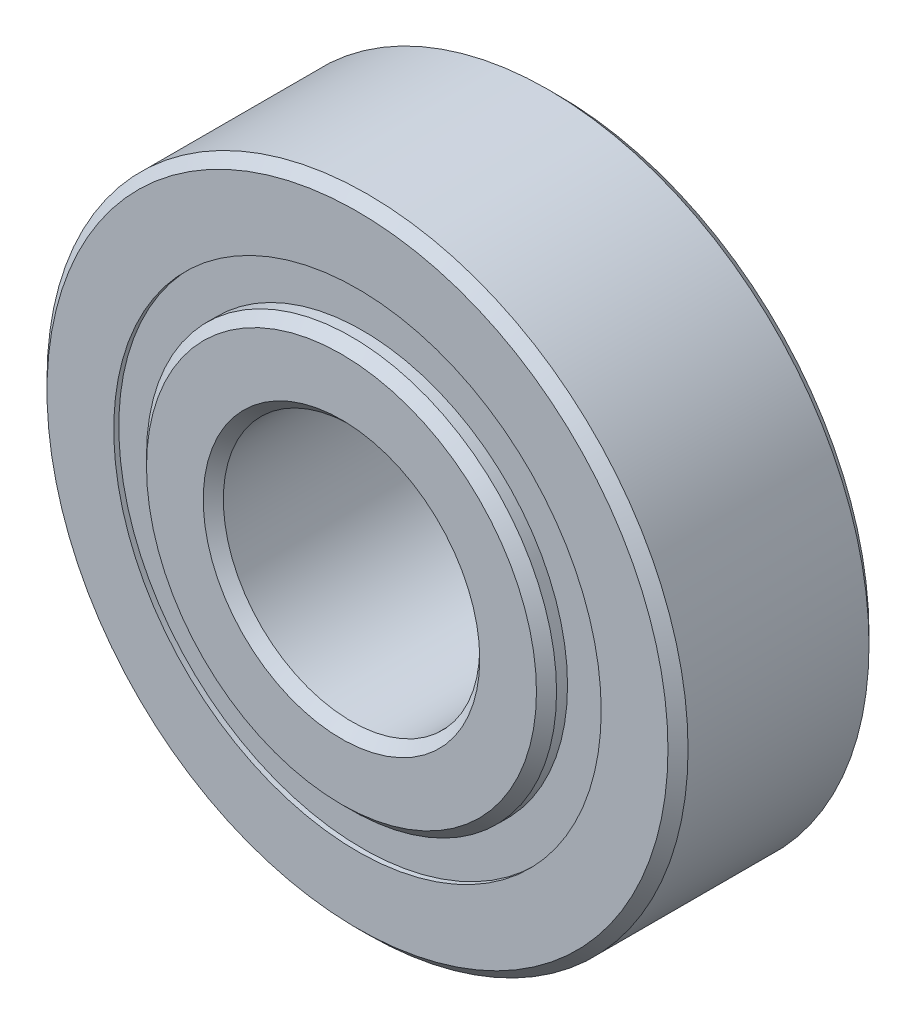
ISO-10303-21;
HEADER;
FILE_DESCRIPTION(('STEP AP214'),'2;1');
FILE_NAME('part.step','',(''),(''),'','','');
FILE_SCHEMA(('AUTOMOTIVE_DESIGN { 1 0 10303 214 1 1 1 1 }'));
ENDSEC;
DATA;
#1=APPLICATION_CONTEXT('core data for automotive mechanical design processes');
#2=APPLICATION_PROTOCOL_DEFINITION('international standard','automotive_design',2000,#1);
#3=PRODUCT_CONTEXT('',#1,'mechanical');
#4=PRODUCT('Part','Part','',(#3));
#5=PRODUCT_RELATED_PRODUCT_CATEGORY('part','',(#4));
#6=PRODUCT_DEFINITION_FORMATION('','',#4);
#7=PRODUCT_DEFINITION_CONTEXT('part definition',#1,'design');
#8=PRODUCT_DEFINITION('design','',#6,#7);
#9=PRODUCT_DEFINITION_SHAPE('','',#8);
#10=(LENGTH_UNIT() NAMED_UNIT(*) SI_UNIT(.MILLI.,.METRE.));
#11=(NAMED_UNIT(*) PLANE_ANGLE_UNIT() SI_UNIT($,.RADIAN.));
#12=(NAMED_UNIT(*) SI_UNIT($,.STERADIAN.) SOLID_ANGLE_UNIT());
#13=UNCERTAINTY_MEASURE_WITH_UNIT(LENGTH_MEASURE(1.E-05),#10,'distance_accuracy_value','');
#14=(GEOMETRIC_REPRESENTATION_CONTEXT(3) GLOBAL_UNCERTAINTY_ASSIGNED_CONTEXT((#13)) GLOBAL_UNIT_ASSIGNED_CONTEXT((#10,
#11,#12)) REPRESENTATION_CONTEXT('',''));
#15=CARTESIAN_POINT('',(0.,0.,0.));
#16=DIRECTION('',(0.,0.,1.));
#17=DIRECTION('',(1.,0.,0.));
#18=AXIS2_PLACEMENT_3D('',#15,#16,#17);
#19=CARTESIAN_POINT('',(0.,6.03522142857143,-2.36474));
#20=DIRECTION('',(0.,0.,1.));
#21=DIRECTION('',(1.,0.,0.));
#22=AXIS2_PLACEMENT_3D('',#19,#20,#21);
#23=PLANE('',#22);
#24=CARTESIAN_POINT('',(0.,0.,-2.36474));
#25=DIRECTION('',(0.,0.,1.));
#26=DIRECTION('',(1.,0.,0.));
#27=AXIS2_PLACEMENT_3D('',#24,#25,#26);
#28=CIRCLE('',#27,6.03522142857143);
#29=CARTESIAN_POINT('',(6.03522142857143,0.,-2.36474));
#30=VERTEX_POINT('',#29);
#31=EDGE_CURVE('E59',#30,#30,#28,.T.);
#32=ORIENTED_EDGE('',*,*,#31,.F.);
#33=EDGE_LOOP('',(#32));
#34=FACE_BOUND('',#33,.T.);
#35=CARTESIAN_POINT('',(0.,0.,-2.36474));
#36=DIRECTION('',(0.,0.,1.));
#37=DIRECTION('',(1.,0.,0.));
#38=AXIS2_PLACEMENT_3D('',#35,#36,#37);
#39=CIRCLE('',#38,5.07727857142857);
#40=CARTESIAN_POINT('',(5.07727857142857,0.,-2.36474));
#41=VERTEX_POINT('',#40);
#42=EDGE_CURVE('E11',#41,#41,#39,.T.);
#43=ORIENTED_EDGE('',*,*,#42,.T.);
#44=EDGE_LOOP('',(#43));
#45=FACE_BOUND('',#44,.T.);
#46=ADVANCED_FACE('F45',(#34,#45),#23,.F.);
#47=CARTESIAN_POINT('',(0.,0.,2.4892));
#48=DIRECTION('',(0.,0.,1.));
#49=DIRECTION('',(1.,0.,0.));
#50=AXIS2_PLACEMENT_3D('',#47,#48,#49);
#51=CYLINDRICAL_SURFACE('',#50,5.07727857142857);
#52=ORIENTED_EDGE('',*,*,#42,.F.);
#53=EDGE_LOOP('',(#52));
#54=FACE_BOUND('',#53,.T.);
#55=CARTESIAN_POINT('',(0.,0.,-1.20554465033679));
#56=DIRECTION('',(0.,0.,1.));
#57=DIRECTION('',(1.,0.,0.));
#58=AXIS2_PLACEMENT_3D('',#55,#56,#57);
#59=CIRCLE('',#58,5.07727857142857);
#60=CARTESIAN_POINT('',(5.07727857142857,0.,-1.20554465033679));
#61=VERTEX_POINT('',#60);
#62=EDGE_CURVE('E51',#61,#61,#59,.T.);
#63=ORIENTED_EDGE('',*,*,#62,.T.);
#64=EDGE_LOOP('',(#63));
#65=FACE_BOUND('',#64,.T.);
#66=ADVANCED_FACE('F68',(#54,#65),#51,.F.);
#67=CARTESIAN_POINT('',(0.,6.03522142857143,-1.20554465033679));
#68=DIRECTION('',(0.,0.,-1.));
#69=DIRECTION('',(-1.,0.,0.));
#70=AXIS2_PLACEMENT_3D('',#67,#68,#69);
#71=PLANE('',#70);
#72=ORIENTED_EDGE('',*,*,#62,.F.);
#73=EDGE_LOOP('',(#72));
#74=FACE_BOUND('',#73,.T.);
#75=CARTESIAN_POINT('',(0.,0.,-1.20554465033679));
#76=DIRECTION('',(0.,0.,1.));
#77=DIRECTION('',(1.,0.,0.));
#78=AXIS2_PLACEMENT_3D('',#75,#76,#77);
#79=CIRCLE('',#78,6.03522142857143);
#80=CARTESIAN_POINT('',(6.03522142857143,0.,-1.20554465033679));
#81=VERTEX_POINT('',#80);
#82=EDGE_CURVE('E55',#81,#81,#79,.T.);
#83=ORIENTED_EDGE('',*,*,#82,.T.);
#84=EDGE_LOOP('',(#83));
#85=FACE_BOUND('',#84,.T.);
#86=ADVANCED_FACE('F72',(#74,#85),#71,.F.);
#87=CARTESIAN_POINT('',(0.,0.,2.4892));
#88=DIRECTION('',(0.,0.,1.));
#89=DIRECTION('',(1.,0.,0.));
#90=AXIS2_PLACEMENT_3D('',#87,#88,#89);
#91=CYLINDRICAL_SURFACE('',#90,6.03522142857143);
#92=ORIENTED_EDGE('',*,*,#82,.F.);
#93=EDGE_LOOP('',(#92));
#94=FACE_BOUND('',#93,.T.);
#95=ORIENTED_EDGE('',*,*,#31,.T.);
#96=EDGE_LOOP('',(#95));
#97=FACE_BOUND('',#96,.T.);
#98=ADVANCED_FACE('F65',(#94,#97),#91,.T.);
#99=CLOSED_SHELL('',(#46,#66,#86,#98));
#100=MANIFOLD_SOLID_BREP('B2',#99);
#101=CARTESIAN_POINT('',(0.,6.03522142857143,2.36474));
#102=DIRECTION('',(0.,0.,-1.));
#103=DIRECTION('',(-1.,0.,0.));
#104=AXIS2_PLACEMENT_3D('',#101,#102,#103);
#105=PLANE('',#104);
#106=CARTESIAN_POINT('',(0.,0.,2.36474));
#107=DIRECTION('',(0.,0.,1.));
#108=DIRECTION('',(1.,0.,0.));
#109=AXIS2_PLACEMENT_3D('',#106,#107,#108);
#110=CIRCLE('',#109,5.07727857142857);
#111=CARTESIAN_POINT('',(5.07727857142857,0.,2.36474));
#112=VERTEX_POINT('',#111);
#113=EDGE_CURVE('E44',#112,#112,#110,.T.);
#114=ORIENTED_EDGE('',*,*,#113,.F.);
#115=EDGE_LOOP('',(#114));
#116=FACE_BOUND('',#115,.T.);
#117=CARTESIAN_POINT('',(0.,0.,2.36474));
#118=DIRECTION('',(0.,0.,1.));
#119=DIRECTION('',(1.,0.,0.));
#120=AXIS2_PLACEMENT_3D('',#117,#118,#119);
#121=CIRCLE('',#120,6.03522142857143);
#122=CARTESIAN_POINT('',(6.03522142857143,0.,2.36474));
#123=VERTEX_POINT('',#122);
#124=EDGE_CURVE('E126',#123,#123,#121,.T.);
#125=ORIENTED_EDGE('',*,*,#124,.T.);
#126=EDGE_LOOP('',(#125));
#127=FACE_BOUND('',#126,.T.);
#128=ADVANCED_FACE('F112',(#116,#127),#105,.F.);
#129=CARTESIAN_POINT('',(0.,0.,2.4892));
#130=DIRECTION('',(0.,0.,1.));
#131=DIRECTION('',(1.,0.,0.));
#132=AXIS2_PLACEMENT_3D('',#129,#130,#131);
#133=CYLINDRICAL_SURFACE('',#132,5.07727857142857);
#134=CARTESIAN_POINT('',(0.,0.,1.20554465033679));
#135=DIRECTION('',(0.,0.,1.));
#136=DIRECTION('',(1.,0.,0.));
#137=AXIS2_PLACEMENT_3D('',#134,#135,#136);
#138=CIRCLE('',#137,5.07727857142857);
#139=CARTESIAN_POINT('',(5.07727857142857,0.,1.20554465033679));
#140=VERTEX_POINT('',#139);
#141=EDGE_CURVE('E118',#140,#140,#138,.T.);
#142=ORIENTED_EDGE('',*,*,#141,.F.);
#143=EDGE_LOOP('',(#142));
#144=FACE_BOUND('',#143,.T.);
#145=ORIENTED_EDGE('',*,*,#113,.T.);
#146=EDGE_LOOP('',(#145));
#147=FACE_BOUND('',#146,.T.);
#148=ADVANCED_FACE('F141',(#144,#147),#133,.F.);
#149=CARTESIAN_POINT('',(0.,6.03522142857143,1.20554465033679));
#150=DIRECTION('',(0.,0.,1.));
#151=DIRECTION('',(1.,0.,0.));
#152=AXIS2_PLACEMENT_3D('',#149,#150,#151);
#153=PLANE('',#152);
#154=CARTESIAN_POINT('',(0.,0.,1.20554465033679));
#155=DIRECTION('',(0.,0.,1.));
#156=DIRECTION('',(1.,0.,0.));
#157=AXIS2_PLACEMENT_3D('',#154,#155,#156);
#158=CIRCLE('',#157,6.03522142857143);
#159=CARTESIAN_POINT('',(6.03522142857143,0.,1.20554465033679));
#160=VERTEX_POINT('',#159);
#161=EDGE_CURVE('E122',#160,#160,#158,.T.);
#162=ORIENTED_EDGE('',*,*,#161,.F.);
#163=EDGE_LOOP('',(#162));
#164=FACE_BOUND('',#163,.T.);
#165=ORIENTED_EDGE('',*,*,#141,.T.);
#166=EDGE_LOOP('',(#165));
#167=FACE_BOUND('',#166,.T.);
#168=ADVANCED_FACE('F136',(#164,#167),#153,.F.);
#169=CARTESIAN_POINT('',(0.,0.,2.4892));
#170=DIRECTION('',(0.,0.,1.));
#171=DIRECTION('',(1.,0.,0.));
#172=AXIS2_PLACEMENT_3D('',#169,#170,#171);
#173=CYLINDRICAL_SURFACE('',#172,6.03522142857143);
#174=ORIENTED_EDGE('',*,*,#124,.F.);
#175=EDGE_LOOP('',(#174));
#176=FACE_BOUND('',#175,.T.);
#177=ORIENTED_EDGE('',*,*,#161,.T.);
#178=EDGE_LOOP('',(#177));
#179=FACE_BOUND('',#178,.T.);
#180=ADVANCED_FACE('F133',(#176,#179),#173,.T.);
#181=CLOSED_SHELL('',(#128,#148,#168,#180));
#182=MANIFOLD_SOLID_BREP('B6',#181);
#183=CARTESIAN_POINT('',(-2.77812499999994,4.81185364977732,0.));
#184=DIRECTION('',(0.,0.,1.));
#185=DIRECTION('',(-0.499999999999989,0.866025403784445,0.));
#186=AXIS2_PLACEMENT_3D('',#183,#184,#185);
#187=SPHERICAL_SURFACE('',#186,1.20554465033679);
#188=CARTESIAN_POINT('',(-2.77812499999994,4.81185364977732,1.20554465033679));
#189=VERTEX_POINT('',#188);
#190=VERTEX_LOOP('',#189);
#191=FACE_BOUND('',#190,.T.);
#192=ADVANCED_FACE('F179',(#191),#187,.T.);
#193=CLOSED_SHELL('',(#192));
#194=MANIFOLD_SOLID_BREP('B39',#193);
#195=CARTESIAN_POINT('',(-4.81185364977726,2.77812500000006,0.));
#196=DIRECTION('',(0.,0.,1.));
#197=DIRECTION('',(-0.866025403784433,0.50000000000001,0.));
#198=AXIS2_PLACEMENT_3D('',#195,#196,#197);
#199=SPHERICAL_SURFACE('',#198,1.20554465033679);
#200=CARTESIAN_POINT('',(-4.81185364977726,2.77812500000006,1.20554465033679));
#201=VERTEX_POINT('',#200);
#202=VERTEX_LOOP('',#201);
#203=FACE_BOUND('',#202,.T.);
#204=ADVANCED_FACE('F199',(#203),#199,.T.);
#205=CLOSED_SHELL('',(#204));
#206=MANIFOLD_SOLID_BREP('B108',#205);
#207=CARTESIAN_POINT('',(-5.55625,0.,0.));
#208=DIRECTION('',(0.,0.,1.));
#209=DIRECTION('',(-1.,0.,0.));
#210=AXIS2_PLACEMENT_3D('',#207,#208,#209);
#211=SPHERICAL_SURFACE('',#210,1.20554465033679);
#212=CARTESIAN_POINT('',(-5.55625,0.,1.20554465033679));
#213=VERTEX_POINT('',#212);
#214=VERTEX_LOOP('',#213);
#215=FACE_BOUND('',#214,.T.);
#216=ADVANCED_FACE('F219',(#215),#211,.T.);
#217=CLOSED_SHELL('',(#216));
#218=MANIFOLD_SOLID_BREP('B175',#217);
#219=CARTESIAN_POINT('',(-4.81185364977731,-2.77812499999996,0.));
#220=DIRECTION('',(0.,0.,1.));
#221=DIRECTION('',(-0.866025403784443,-0.499999999999992,0.));
#222=AXIS2_PLACEMENT_3D('',#219,#220,#221);
#223=SPHERICAL_SURFACE('',#222,1.20554465033679);
#224=CARTESIAN_POINT('',(-4.81185364977731,-2.77812499999996,1.20554465033679));
#225=VERTEX_POINT('',#224);
#226=VERTEX_LOOP('',#225);
#227=FACE_BOUND('',#226,.T.);
#228=ADVANCED_FACE('F239',(#227),#223,.T.);
#229=CLOSED_SHELL('',(#228));
#230=MANIFOLD_SOLID_BREP('B195',#229);
#231=CARTESIAN_POINT('',(-2.77812500000004,-4.81185364977727,0.));
#232=DIRECTION('',(0.,0.,1.));
#233=DIRECTION('',(-0.500000000000007,-0.866025403784435,0.));
#234=AXIS2_PLACEMENT_3D('',#231,#232,#233);
#235=SPHERICAL_SURFACE('',#234,1.20554465033679);
#236=CARTESIAN_POINT('',(-2.77812500000004,-4.81185364977727,1.20554465033679));
#237=VERTEX_POINT('',#236);
#238=VERTEX_LOOP('',#237);
#239=FACE_BOUND('',#238,.T.);
#240=ADVANCED_FACE('F259',(#239),#235,.T.);
#241=CLOSED_SHELL('',(#240));
#242=MANIFOLD_SOLID_BREP('B215',#241);
#243=CARTESIAN_POINT('',(0.,-5.55625,0.));
#244=DIRECTION('',(0.,0.,1.));
#245=DIRECTION('',(0.,-1.,0.));
#246=AXIS2_PLACEMENT_3D('',#243,#244,#245);
#247=SPHERICAL_SURFACE('',#246,1.20554465033679);
#248=CARTESIAN_POINT('',(0.,-5.55625,1.20554465033679));
#249=VERTEX_POINT('',#248);
#250=VERTEX_LOOP('',#249);
#251=FACE_BOUND('',#250,.T.);
#252=ADVANCED_FACE('F279',(#251),#247,.T.);
#253=CLOSED_SHELL('',(#252));
#254=MANIFOLD_SOLID_BREP('B235',#253);
#255=CARTESIAN_POINT('',(2.77812499999997,-4.8118536497773,0.));
#256=DIRECTION('',(0.,0.,1.));
#257=DIRECTION('',(0.499999999999995,-0.866025403784442,0.));
#258=AXIS2_PLACEMENT_3D('',#255,#256,#257);
#259=SPHERICAL_SURFACE('',#258,1.20554465033679);
#260=CARTESIAN_POINT('',(2.77812499999997,-4.8118536497773,1.20554465033679));
#261=VERTEX_POINT('',#260);
#262=VERTEX_LOOP('',#261);
#263=FACE_BOUND('',#262,.T.);
#264=ADVANCED_FACE('F299',(#263),#259,.T.);
#265=CLOSED_SHELL('',(#264));
#266=MANIFOLD_SOLID_BREP('B255',#265);
#267=CARTESIAN_POINT('',(4.81185364977728,-2.77812500000002,0.));
#268=DIRECTION('',(0.,0.,1.));
#269=DIRECTION('',(0.866025403784436,-0.500000000000004,0.));
#270=AXIS2_PLACEMENT_3D('',#267,#268,#269);
#271=SPHERICAL_SURFACE('',#270,1.20554465033679);
#272=CARTESIAN_POINT('',(4.81185364977728,-2.77812500000002,1.20554465033679));
#273=VERTEX_POINT('',#272);
#274=VERTEX_LOOP('',#273);
#275=FACE_BOUND('',#274,.T.);
#276=ADVANCED_FACE('F319',(#275),#271,.T.);
#277=CLOSED_SHELL('',(#276));
#278=MANIFOLD_SOLID_BREP('B275',#277);
#279=CARTESIAN_POINT('',(5.55625,0.,0.));
#280=DIRECTION('',(0.,0.,1.));
#281=DIRECTION('',(1.,0.,0.));
#282=AXIS2_PLACEMENT_3D('',#279,#280,#281);
#283=SPHERICAL_SURFACE('',#282,1.20554465033679);
#284=CARTESIAN_POINT('',(5.55625,0.,1.20554465033679));
#285=VERTEX_POINT('',#284);
#286=VERTEX_LOOP('',#285);
#287=FACE_BOUND('',#286,.T.);
#288=ADVANCED_FACE('F339',(#287),#283,.T.);
#289=CLOSED_SHELL('',(#288));
#290=MANIFOLD_SOLID_BREP('B295',#289);
#291=CARTESIAN_POINT('',(4.81185364977729,2.77812499999999,0.));
#292=DIRECTION('',(0.,0.,1.));
#293=DIRECTION('',(0.86602540378444,0.499999999999998,0.));
#294=AXIS2_PLACEMENT_3D('',#291,#292,#293);
#295=SPHERICAL_SURFACE('',#294,1.20554465033679);
#296=CARTESIAN_POINT('',(4.81185364977729,2.77812499999999,1.20554465033679));
#297=VERTEX_POINT('',#296);
#298=VERTEX_LOOP('',#297);
#299=FACE_BOUND('',#298,.T.);
#300=ADVANCED_FACE('F359',(#299),#295,.T.);
#301=CLOSED_SHELL('',(#300));
#302=MANIFOLD_SOLID_BREP('B315',#301);
#303=CARTESIAN_POINT('',(2.77812500000001,4.81185364977728,0.));
#304=DIRECTION('',(0.,0.,1.));
#305=DIRECTION('',(0.500000000000001,0.866025403784438,0.));
#306=AXIS2_PLACEMENT_3D('',#303,#304,#305);
#307=SPHERICAL_SURFACE('',#306,1.20554465033679);
#308=CARTESIAN_POINT('',(2.77812500000001,4.81185364977728,1.20554465033679));
#309=VERTEX_POINT('',#308);
#310=VERTEX_LOOP('',#309);
#311=FACE_BOUND('',#310,.T.);
#312=ADVANCED_FACE('F379',(#311),#307,.T.);
#313=CLOSED_SHELL('',(#312));
#314=MANIFOLD_SOLID_BREP('B335',#313);
#315=CARTESIAN_POINT('',(0.,5.55625,0.));
#316=DIRECTION('',(0.,0.,1.));
#317=DIRECTION('',(0.,1.,0.));
#318=AXIS2_PLACEMENT_3D('',#315,#316,#317);
#319=SPHERICAL_SURFACE('',#318,1.20554465033679);
#320=CARTESIAN_POINT('',(0.,5.55625,1.20554465033679));
#321=VERTEX_POINT('',#320);
#322=VERTEX_LOOP('',#321);
#323=FACE_BOUND('',#322,.T.);
#324=ADVANCED_FACE('F401',(#323),#319,.T.);
#325=CLOSED_SHELL('',(#324));
#326=MANIFOLD_SOLID_BREP('B355',#325);
#327=CARTESIAN_POINT('',(0.,0.,2.63652));
#328=DIRECTION('',(0.,0.,-1.));
#329=DIRECTION('',(-1.,0.,0.));
#330=AXIS2_PLACEMENT_3D('',#327,#328,#329);
#331=CONICAL_SURFACE('',#330,5.07727857142857,0.785398163397439);
#332=CARTESIAN_POINT('',(0.,0.,2.88544));
#333=DIRECTION('',(0.,0.,1.));
#334=DIRECTION('',(1.,0.,0.));
#335=AXIS2_PLACEMENT_3D('',#332,#333,#334);
#336=CIRCLE('',#335,4.82835857142857);
#337=CARTESIAN_POINT('',(4.82835857142857,0.,2.88544));
#338=VERTEX_POINT('',#337);
#339=EDGE_CURVE('E454',#338,#338,#336,.T.);
#340=ORIENTED_EDGE('',*,*,#339,.F.);
#341=EDGE_LOOP('',(#340));
#342=FACE_BOUND('',#341,.T.);
#343=CARTESIAN_POINT('',(0.,0.,2.63652));
#344=DIRECTION('',(0.,0.,1.));
#345=DIRECTION('',(1.,0.,0.));
#346=AXIS2_PLACEMENT_3D('',#343,#344,#345);
#347=CIRCLE('',#346,5.07727857142857);
#348=CARTESIAN_POINT('',(5.07727857142857,0.,2.63652));
#349=VERTEX_POINT('',#348);
#350=EDGE_CURVE('E400',#349,#349,#347,.T.);
#351=ORIENTED_EDGE('',*,*,#350,.T.);
#352=EDGE_LOOP('',(#351));
#353=FACE_BOUND('',#352,.T.);
#354=ADVANCED_FACE('F420',(#342,#353),#331,.T.);
#355=CARTESIAN_POINT('',(0.,0.,2.4892));
#356=DIRECTION('',(0.,0.,1.));
#357=DIRECTION('',(1.,0.,0.));
#358=AXIS2_PLACEMENT_3D('',#355,#356,#357);
#359=CYLINDRICAL_SURFACE('',#358,5.07727857142857);
#360=ORIENTED_EDGE('',*,*,#350,.F.);
#361=EDGE_LOOP('',(#360));
#362=FACE_BOUND('',#361,.T.);
#363=CARTESIAN_POINT('',(0.,0.,1.10631111111111));
#364=DIRECTION('',(0.,0.,1.));
#365=DIRECTION('',(1.,0.,0.));
#366=AXIS2_PLACEMENT_3D('',#363,#364,#365);
#367=CIRCLE('',#366,5.07727857142857);
#368=CARTESIAN_POINT('',(5.07727857142857,0.,1.10631111111111));
#369=VERTEX_POINT('',#368);
#370=EDGE_CURVE('E426',#369,#369,#367,.T.);
#371=ORIENTED_EDGE('',*,*,#370,.T.);
#372=EDGE_LOOP('',(#371));
#373=FACE_BOUND('',#372,.T.);
#374=ADVANCED_FACE('F461',(#362,#373),#359,.T.);
#375=CARTESIAN_POINT('',(0.,0.,0.));
#376=DIRECTION('',(0.,0.,1.));
#377=DIRECTION('',(1.,0.,0.));
#378=AXIS2_PLACEMENT_3D('',#375,#376,#377);
#379=TOROIDAL_SURFACE('',#378,5.55625,1.20554465033679);
#380=ORIENTED_EDGE('',*,*,#370,.F.);
#381=EDGE_LOOP('',(#380));
#382=FACE_BOUND('',#381,.T.);
#383=CARTESIAN_POINT('',(0.,0.,-1.10631111111111));
#384=DIRECTION('',(0.,0.,1.));
#385=DIRECTION('',(1.,0.,0.));
#386=AXIS2_PLACEMENT_3D('',#383,#384,#385);
#387=CIRCLE('',#386,5.07727857142857);
#388=CARTESIAN_POINT('',(5.07727857142857,0.,-1.10631111111111));
#389=VERTEX_POINT('',#388);
#390=EDGE_CURVE('E430',#389,#389,#387,.T.);
#391=ORIENTED_EDGE('',*,*,#390,.T.);
#392=EDGE_LOOP('',(#391));
#393=FACE_BOUND('',#392,.T.);
#394=ADVANCED_FACE('F465',(#382,#393),#379,.F.);
#395=CARTESIAN_POINT('',(0.,0.,2.4892));
#396=DIRECTION('',(0.,0.,1.));
#397=DIRECTION('',(1.,0.,0.));
#398=AXIS2_PLACEMENT_3D('',#395,#396,#397);
#399=CYLINDRICAL_SURFACE('',#398,5.07727857142857);
#400=ORIENTED_EDGE('',*,*,#390,.F.);
#401=EDGE_LOOP('',(#400));
#402=FACE_BOUND('',#401,.T.);
#403=CARTESIAN_POINT('',(0.,0.,-2.63652));
#404=DIRECTION('',(0.,0.,1.));
#405=DIRECTION('',(1.,0.,0.));
#406=AXIS2_PLACEMENT_3D('',#403,#404,#405);
#407=CIRCLE('',#406,5.07727857142857);
#408=CARTESIAN_POINT('',(5.07727857142857,0.,-2.63652));
#409=VERTEX_POINT('',#408);
#410=EDGE_CURVE('E434',#409,#409,#407,.T.);
#411=ORIENTED_EDGE('',*,*,#410,.T.);
#412=EDGE_LOOP('',(#411));
#413=FACE_BOUND('',#412,.T.);
#414=ADVANCED_FACE('F470',(#402,#413),#399,.T.);
#415=CARTESIAN_POINT('',(0.,0.,-2.88544));
#416=DIRECTION('',(0.,0.,1.));
#417=DIRECTION('',(1.,0.,0.));
#418=AXIS2_PLACEMENT_3D('',#415,#416,#417);
#419=CONICAL_SURFACE('',#418,4.82835857142857,0.785398163397447);
#420=ORIENTED_EDGE('',*,*,#410,.F.);
#421=EDGE_LOOP('',(#420));
#422=FACE_BOUND('',#421,.T.);
#423=CARTESIAN_POINT('',(0.,0.,-2.88544));
#424=DIRECTION('',(0.,0.,1.));
#425=DIRECTION('',(1.,0.,0.));
#426=AXIS2_PLACEMENT_3D('',#423,#424,#425);
#427=CIRCLE('',#426,4.82835857142857);
#428=CARTESIAN_POINT('',(4.82835857142857,0.,-2.88544));
#429=VERTEX_POINT('',#428);
#430=EDGE_CURVE('E439',#429,#429,#427,.T.);
#431=ORIENTED_EDGE('',*,*,#430,.T.);
#432=EDGE_LOOP('',(#431));
#433=FACE_BOUND('',#432,.T.);
#434=ADVANCED_FACE('F476',(#422,#433),#419,.T.);
#435=CARTESIAN_POINT('',(0.,4.82835857142857,-2.88544));
#436=DIRECTION('',(0.,0.,1.));
#437=DIRECTION('',(1.,0.,0.));
#438=AXIS2_PLACEMENT_3D('',#435,#436,#437);
#439=PLANE('',#438);
#440=ORIENTED_EDGE('',*,*,#430,.F.);
#441=EDGE_LOOP('',(#440));
#442=FACE_BOUND('',#441,.T.);
#443=CARTESIAN_POINT('',(0.,0.,-2.88544));
#444=DIRECTION('',(0.,0.,1.));
#445=DIRECTION('',(1.,0.,0.));
#446=AXIS2_PLACEMENT_3D('',#443,#444,#445);
#447=CIRCLE('',#446,3.42392000000007);
#448=CARTESIAN_POINT('',(3.42392000000007,0.,-2.88544));
#449=VERTEX_POINT('',#448);
#450=EDGE_CURVE('E442',#449,#449,#447,.T.);
#451=ORIENTED_EDGE('',*,*,#450,.T.);
#452=EDGE_LOOP('',(#451));
#453=FACE_BOUND('',#452,.T.);
#454=ADVANCED_FACE('F480',(#442,#453),#439,.F.);
#455=CARTESIAN_POINT('',(0.,0.,-2.63652));
#456=DIRECTION('',(0.,0.,-1.));
#457=DIRECTION('',(-1.,0.,0.));
#458=AXIS2_PLACEMENT_3D('',#455,#456,#457);
#459=CONICAL_SURFACE('',#458,3.17500000000007,0.785398163397452);
#460=ORIENTED_EDGE('',*,*,#450,.F.);
#461=EDGE_LOOP('',(#460));
#462=FACE_BOUND('',#461,.T.);
#463=CARTESIAN_POINT('',(0.,0.,-2.63652));
#464=DIRECTION('',(0.,0.,1.));
#465=DIRECTION('',(1.,0.,0.));
#466=AXIS2_PLACEMENT_3D('',#463,#464,#465);
#467=CIRCLE('',#466,3.17500000000007);
#468=CARTESIAN_POINT('',(3.17500000000007,0.,-2.63652));
#469=VERTEX_POINT('',#468);
#470=EDGE_CURVE('E445',#469,#469,#467,.T.);
#471=ORIENTED_EDGE('',*,*,#470,.T.);
#472=EDGE_LOOP('',(#471));
#473=FACE_BOUND('',#472,.T.);
#474=ADVANCED_FACE('F484',(#462,#473),#459,.F.);
#475=CARTESIAN_POINT('',(0.,0.,2.4892));
#476=DIRECTION('',(0.,0.,1.));
#477=DIRECTION('',(1.,0.,0.));
#478=AXIS2_PLACEMENT_3D('',#475,#476,#477);
#479=CYLINDRICAL_SURFACE('',#478,3.17500000000003);
#480=ORIENTED_EDGE('',*,*,#470,.F.);
#481=EDGE_LOOP('',(#480));
#482=FACE_BOUND('',#481,.T.);
#483=CARTESIAN_POINT('',(0.,0.,2.63652));
#484=DIRECTION('',(0.,0.,1.));
#485=DIRECTION('',(1.,0.,0.));
#486=AXIS2_PLACEMENT_3D('',#483,#484,#485);
#487=CIRCLE('',#486,3.175);
#488=CARTESIAN_POINT('',(3.175,0.,2.63652));
#489=VERTEX_POINT('',#488);
#490=EDGE_CURVE('E448',#489,#489,#487,.T.);
#491=ORIENTED_EDGE('',*,*,#490,.T.);
#492=EDGE_LOOP('',(#491));
#493=FACE_BOUND('',#492,.T.);
#494=ADVANCED_FACE('F488',(#482,#493),#479,.F.);
#495=CARTESIAN_POINT('',(0.,0.,2.88544));
#496=DIRECTION('',(0.,0.,1.));
#497=DIRECTION('',(1.,0.,0.));
#498=AXIS2_PLACEMENT_3D('',#495,#496,#497);
#499=CONICAL_SURFACE('',#498,3.42392,0.785398163397436);
#500=ORIENTED_EDGE('',*,*,#490,.F.);
#501=EDGE_LOOP('',(#500));
#502=FACE_BOUND('',#501,.T.);
#503=CARTESIAN_POINT('',(0.,0.,2.88544));
#504=DIRECTION('',(0.,0.,1.));
#505=DIRECTION('',(1.,0.,0.));
#506=AXIS2_PLACEMENT_3D('',#503,#504,#505);
#507=CIRCLE('',#506,3.42392);
#508=CARTESIAN_POINT('',(3.42392,0.,2.88544));
#509=VERTEX_POINT('',#508);
#510=EDGE_CURVE('E451',#509,#509,#507,.T.);
#511=ORIENTED_EDGE('',*,*,#510,.T.);
#512=EDGE_LOOP('',(#511));
#513=FACE_BOUND('',#512,.T.);
#514=ADVANCED_FACE('F492',(#502,#513),#499,.F.);
#515=CARTESIAN_POINT('',(0.,3.42392,2.88544));
#516=DIRECTION('',(0.,0.,-1.));
#517=DIRECTION('',(-1.,0.,0.));
#518=AXIS2_PLACEMENT_3D('',#515,#516,#517);
#519=PLANE('',#518);
#520=ORIENTED_EDGE('',*,*,#510,.F.);
#521=EDGE_LOOP('',(#520));
#522=FACE_BOUND('',#521,.T.);
#523=ORIENTED_EDGE('',*,*,#339,.T.);
#524=EDGE_LOOP('',(#523));
#525=FACE_BOUND('',#524,.T.);
#526=ADVANCED_FACE('F458',(#522,#525),#519,.F.);
#527=CLOSED_SHELL('',(#354,#374,#394,#414,#434,#454,#474,#494,#514,#526));
#528=MANIFOLD_SOLID_BREP('B375',#527);
#529=CARTESIAN_POINT('',(0.,0.,2.24028));
#530=DIRECTION('',(0.,0.,-1.));
#531=DIRECTION('',(-1.,0.,0.));
#532=AXIS2_PLACEMENT_3D('',#529,#530,#531);
#533=CONICAL_SURFACE('',#532,7.9375,0.785398163397447);
#534=CARTESIAN_POINT('',(0.,0.,2.4892));
#535=DIRECTION('',(0.,0.,1.));
#536=DIRECTION('',(1.,0.,0.));
#537=AXIS2_PLACEMENT_3D('',#534,#535,#536);
#538=CIRCLE('',#537,7.68858);
#539=CARTESIAN_POINT('',(7.68858,0.,2.4892));
#540=VERTEX_POINT('',#539);
#541=EDGE_CURVE('E599',#540,#540,#538,.T.);
#542=ORIENTED_EDGE('',*,*,#541,.F.);
#543=EDGE_LOOP('',(#542));
#544=FACE_BOUND('',#543,.T.);
#545=CARTESIAN_POINT('',(0.,0.,2.24028));
#546=DIRECTION('',(0.,0.,1.));
#547=DIRECTION('',(1.,0.,0.));
#548=AXIS2_PLACEMENT_3D('',#545,#546,#547);
#549=CIRCLE('',#548,7.9375);
#550=CARTESIAN_POINT('',(7.9375,0.,2.24028));
#551=VERTEX_POINT('',#550);
#552=EDGE_CURVE('E419',#551,#551,#549,.T.);
#553=ORIENTED_EDGE('',*,*,#552,.T.);
#554=EDGE_LOOP('',(#553));
#555=FACE_BOUND('',#554,.T.);
#556=ADVANCED_FACE('F571',(#544,#555),#533,.T.);
#557=CARTESIAN_POINT('',(0.,0.,2.4892));
#558=DIRECTION('',(0.,0.,1.));
#559=DIRECTION('',(1.,0.,0.));
#560=AXIS2_PLACEMENT_3D('',#557,#558,#559);
#561=CYLINDRICAL_SURFACE('',#560,7.9375);
#562=ORIENTED_EDGE('',*,*,#552,.F.);
#563=EDGE_LOOP('',(#562));
#564=FACE_BOUND('',#563,.T.);
#565=CARTESIAN_POINT('',(0.,0.,-2.24028));
#566=DIRECTION('',(0.,0.,1.));
#567=DIRECTION('',(1.,0.,0.));
#568=AXIS2_PLACEMENT_3D('',#565,#566,#567);
#569=CIRCLE('',#568,7.9375);
#570=CARTESIAN_POINT('',(7.9375,0.,-2.24028));
#571=VERTEX_POINT('',#570);
#572=EDGE_CURVE('E577',#571,#571,#569,.T.);
#573=ORIENTED_EDGE('',*,*,#572,.T.);
#574=EDGE_LOOP('',(#573));
#575=FACE_BOUND('',#574,.T.);
#576=ADVANCED_FACE('F606',(#564,#575),#561,.T.);
#577=CARTESIAN_POINT('',(0.,0.,-2.4892));
#578=DIRECTION('',(0.,0.,1.));
#579=DIRECTION('',(1.,0.,0.));
#580=AXIS2_PLACEMENT_3D('',#577,#578,#579);
#581=CONICAL_SURFACE('',#580,7.68858,0.785398163397445);
#582=ORIENTED_EDGE('',*,*,#572,.F.);
#583=EDGE_LOOP('',(#582));
#584=FACE_BOUND('',#583,.T.);
#585=CARTESIAN_POINT('',(0.,0.,-2.4892));
#586=DIRECTION('',(0.,0.,1.));
#587=DIRECTION('',(1.,0.,0.));
#588=AXIS2_PLACEMENT_3D('',#585,#586,#587);
#589=CIRCLE('',#588,7.68858);
#590=CARTESIAN_POINT('',(7.68858,0.,-2.4892));
#591=VERTEX_POINT('',#590);
#592=EDGE_CURVE('E581',#591,#591,#589,.T.);
#593=ORIENTED_EDGE('',*,*,#592,.T.);
#594=EDGE_LOOP('',(#593));
#595=FACE_BOUND('',#594,.T.);
#596=ADVANCED_FACE('F610',(#584,#595),#581,.T.);
#597=CARTESIAN_POINT('',(0.,7.68858,-2.4892));
#598=DIRECTION('',(0.,0.,1.));
#599=DIRECTION('',(1.,0.,0.));
#600=AXIS2_PLACEMENT_3D('',#597,#598,#599);
#601=PLANE('',#600);
#602=ORIENTED_EDGE('',*,*,#592,.F.);
#603=EDGE_LOOP('',(#602));
#604=FACE_BOUND('',#603,.T.);
#605=CARTESIAN_POINT('',(0.,0.,-2.4892));
#606=DIRECTION('',(0.,0.,1.));
#607=DIRECTION('',(1.,0.,0.));
#608=AXIS2_PLACEMENT_3D('',#605,#606,#607);
#609=CIRCLE('',#608,6.03522142857143);
#610=CARTESIAN_POINT('',(6.03522142857143,0.,-2.4892));
#611=VERTEX_POINT('',#610);
#612=EDGE_CURVE('E585',#611,#611,#609,.T.);
#613=ORIENTED_EDGE('',*,*,#612,.T.);
#614=EDGE_LOOP('',(#613));
#615=FACE_BOUND('',#614,.T.);
#616=ADVANCED_FACE('F615',(#604,#615),#601,.F.);
#617=CARTESIAN_POINT('',(0.,0.,2.4892));
#618=DIRECTION('',(0.,0.,1.));
#619=DIRECTION('',(1.,0.,0.));
#620=AXIS2_PLACEMENT_3D('',#617,#618,#619);
#621=CYLINDRICAL_SURFACE('',#620,6.03522142857143);
#622=ORIENTED_EDGE('',*,*,#612,.F.);
#623=EDGE_LOOP('',(#622));
#624=FACE_BOUND('',#623,.T.);
#625=CARTESIAN_POINT('',(0.,0.,-1.10631111111111));
#626=DIRECTION('',(0.,0.,1.));
#627=DIRECTION('',(1.,0.,0.));
#628=AXIS2_PLACEMENT_3D('',#625,#626,#627);
#629=CIRCLE('',#628,6.03522142857143);
#630=CARTESIAN_POINT('',(6.03522142857143,0.,-1.10631111111111));
#631=VERTEX_POINT('',#630);
#632=EDGE_CURVE('E590',#631,#631,#629,.T.);
#633=ORIENTED_EDGE('',*,*,#632,.T.);
#634=EDGE_LOOP('',(#633));
#635=FACE_BOUND('',#634,.T.);
#636=ADVANCED_FACE('F621',(#624,#635),#621,.F.);
#637=CARTESIAN_POINT('',(0.,0.,0.));
#638=DIRECTION('',(0.,0.,1.));
#639=DIRECTION('',(1.,0.,0.));
#640=AXIS2_PLACEMENT_3D('',#637,#638,#639);
#641=TOROIDAL_SURFACE('',#640,5.55625,1.20554465033679);
#642=ORIENTED_EDGE('',*,*,#632,.F.);
#643=EDGE_LOOP('',(#642));
#644=FACE_BOUND('',#643,.T.);
#645=CARTESIAN_POINT('',(0.,0.,1.10631111111111));
#646=DIRECTION('',(0.,0.,1.));
#647=DIRECTION('',(1.,0.,0.));
#648=AXIS2_PLACEMENT_3D('',#645,#646,#647);
#649=CIRCLE('',#648,6.03522142857143);
#650=CARTESIAN_POINT('',(6.03522142857143,0.,1.10631111111111));
#651=VERTEX_POINT('',#650);
#652=EDGE_CURVE('E593',#651,#651,#649,.T.);
#653=ORIENTED_EDGE('',*,*,#652,.T.);
#654=EDGE_LOOP('',(#653));
#655=FACE_BOUND('',#654,.T.);
#656=ADVANCED_FACE('F625',(#644,#655),#641,.F.);
#657=CARTESIAN_POINT('',(0.,0.,2.4892));
#658=DIRECTION('',(0.,0.,1.));
#659=DIRECTION('',(1.,0.,0.));
#660=AXIS2_PLACEMENT_3D('',#657,#658,#659);
#661=CYLINDRICAL_SURFACE('',#660,6.03522142857143);
#662=ORIENTED_EDGE('',*,*,#652,.F.);
#663=EDGE_LOOP('',(#662));
#664=FACE_BOUND('',#663,.T.);
#665=CARTESIAN_POINT('',(0.,0.,2.4892));
#666=DIRECTION('',(0.,0.,1.));
#667=DIRECTION('',(1.,0.,0.));
#668=AXIS2_PLACEMENT_3D('',#665,#666,#667);
#669=CIRCLE('',#668,6.03522142857143);
#670=CARTESIAN_POINT('',(6.03522142857143,0.,2.4892));
#671=VERTEX_POINT('',#670);
#672=EDGE_CURVE('E596',#671,#671,#669,.T.);
#673=ORIENTED_EDGE('',*,*,#672,.T.);
#674=EDGE_LOOP('',(#673));
#675=FACE_BOUND('',#674,.T.);
#676=ADVANCED_FACE('F629',(#664,#675),#661,.F.);
#677=CARTESIAN_POINT('',(0.,7.68858,2.4892));
#678=DIRECTION('',(0.,0.,-1.));
#679=DIRECTION('',(-1.,0.,0.));
#680=AXIS2_PLACEMENT_3D('',#677,#678,#679);
#681=PLANE('',#680);
#682=ORIENTED_EDGE('',*,*,#672,.F.);
#683=EDGE_LOOP('',(#682));
#684=FACE_BOUND('',#683,.T.);
#685=ORIENTED_EDGE('',*,*,#541,.T.);
#686=EDGE_LOOP('',(#685));
#687=FACE_BOUND('',#686,.T.);
#688=ADVANCED_FACE('F603',(#684,#687),#681,.F.);
#689=CLOSED_SHELL('',(#556,#576,#596,#616,#636,#656,#676,#688));
#690=MANIFOLD_SOLID_BREP('B395',#689);
#691=ADVANCED_BREP_SHAPE_REPRESENTATION('',(#18,#100,#182,#194,#206,#218,#230,#242,#254,#266,
#278,#290,#302,#314,#326,#528,#690),#14);
#692=SHAPE_DEFINITION_REPRESENTATION(#9,#691);
ENDSEC;
END-ISO-10303-21;
